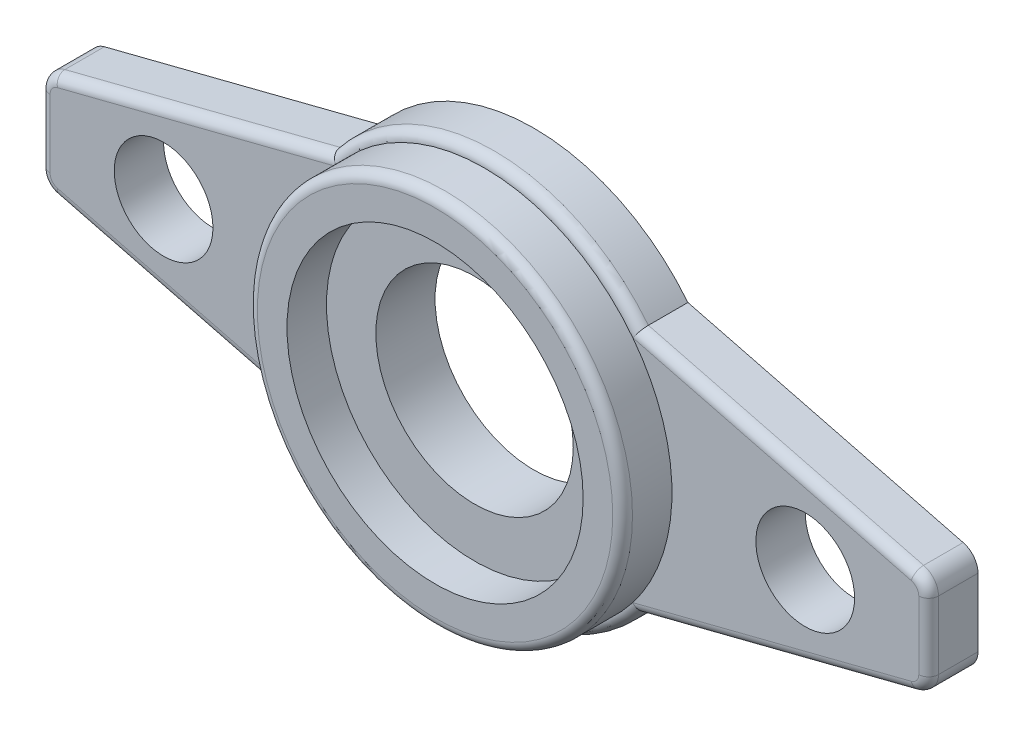
ISO-10303-21;
HEADER;
FILE_DESCRIPTION(('STEP AP214'),'2;1');
FILE_NAME('part.step','',(''),(''),'','','');
FILE_SCHEMA(('AUTOMOTIVE_DESIGN { 1 0 10303 214 1 1 1 1 }'));
ENDSEC;
DATA;
#1=APPLICATION_CONTEXT('core data for automotive mechanical design processes');
#2=APPLICATION_PROTOCOL_DEFINITION('international standard','automotive_design',2000,#1);
#3=PRODUCT_CONTEXT('',#1,'mechanical');
#4=PRODUCT('Part','Part','',(#3));
#5=PRODUCT_RELATED_PRODUCT_CATEGORY('part','',(#4));
#6=PRODUCT_DEFINITION_FORMATION('','',#4);
#7=PRODUCT_DEFINITION_CONTEXT('part definition',#1,'design');
#8=PRODUCT_DEFINITION('design','',#6,#7);
#9=PRODUCT_DEFINITION_SHAPE('','',#8);
#10=(LENGTH_UNIT() NAMED_UNIT(*) SI_UNIT(.MILLI.,.METRE.));
#11=(NAMED_UNIT(*) PLANE_ANGLE_UNIT() SI_UNIT($,.RADIAN.));
#12=(NAMED_UNIT(*) SI_UNIT($,.STERADIAN.) SOLID_ANGLE_UNIT());
#13=UNCERTAINTY_MEASURE_WITH_UNIT(LENGTH_MEASURE(1.E-05),#10,'distance_accuracy_value','');
#14=(GEOMETRIC_REPRESENTATION_CONTEXT(3) GLOBAL_UNCERTAINTY_ASSIGNED_CONTEXT((#13)) GLOBAL_UNIT_ASSIGNED_CONTEXT((#10,
#11,#12)) REPRESENTATION_CONTEXT('',''));
#15=CARTESIAN_POINT('',(0.,0.,0.));
#16=DIRECTION('',(0.,0.,1.));
#17=DIRECTION('',(1.,0.,0.));
#18=AXIS2_PLACEMENT_3D('',#15,#16,#17);
#19=CARTESIAN_POINT('',(0.,0.,5.));
#20=DIRECTION('',(0.,0.,1.));
#21=DIRECTION('',(1.,0.,0.));
#22=AXIS2_PLACEMENT_3D('',#19,#20,#21);
#23=PLANE('',#22);
#24=CARTESIAN_POINT('',(32.5,0.,5.));
#25=DIRECTION('',(0.,0.,1.));
#26=DIRECTION('',(1.,0.,0.));
#27=AXIS2_PLACEMENT_3D('',#24,#25,#26);
#28=CIRCLE('',#27,5.);
#29=CARTESIAN_POINT('',(37.5,0.,5.));
#30=VERTEX_POINT('',#29);
#31=EDGE_CURVE('E200',#30,#30,#28,.T.);
#32=ORIENTED_EDGE('',*,*,#31,.F.);
#33=EDGE_LOOP('',(#32));
#34=FACE_BOUND('',#33,.T.);
#35=CARTESIAN_POINT('',(43.,3.4463159724792,5.));
#36=DIRECTION('',(0.,0.,1.));
#37=DIRECTION('',(1.,0.,0.));
#38=AXIS2_PLACEMENT_3D('',#35,#36,#37);
#39=CIRCLE('',#38,1.);
#40=CARTESIAN_POINT('',(44.,3.4463159724792,5.));
#41=VERTEX_POINT('',#40);
#42=CARTESIAN_POINT('',(43.2472844167774,4.41525891054058,5.));
#43=VERTEX_POINT('',#42);
#44=EDGE_CURVE('E279',#41,#43,#39,.T.);
#45=ORIENTED_EDGE('',*,*,#44,.T.);
#46=DIRECTION('',(-0.968942938061382,0.247284416777479,0.));
#47=VECTOR('',#46,1.);
#48=CARTESIAN_POINT('',(15.3652105792185,11.5310570619386,5.));
#49=LINE('',#48,#47);
#50=CARTESIAN_POINT('',(15.0363618048333,11.6149827237991,5.));
#51=VERTEX_POINT('',#50);
#52=EDGE_CURVE('E281',#43,#51,#49,.T.);
#53=ORIENTED_EDGE('',*,*,#52,.T.);
#54=CARTESIAN_POINT('',(0.,0.,5.));
#55=DIRECTION('',(0.,0.,1.));
#56=DIRECTION('',(1.,0.,0.));
#57=AXIS2_PLACEMENT_3D('',#54,#55,#56);
#58=CIRCLE('',#57,19.);
#59=CARTESIAN_POINT('',(15.0363618048333,-11.6149827237991,5.));
#60=VERTEX_POINT('',#59);
#61=EDGE_CURVE('E420',#60,#51,#58,.T.);
#62=ORIENTED_EDGE('',*,*,#61,.F.);
#63=DIRECTION('',(-0.968942938061382,-0.247284416777479,0.));
#64=VECTOR('',#63,1.);
#65=CARTESIAN_POINT('',(3.70246925501234,-14.5075111678462,5.));
#66=LINE('',#65,#64);
#67=CARTESIAN_POINT('',(43.2472844167775,-4.41525891054058,5.));
#68=VERTEX_POINT('',#67);
#69=EDGE_CURVE('E273',#60,#68,#66,.F.);
#70=ORIENTED_EDGE('',*,*,#69,.T.);
#71=CARTESIAN_POINT('',(43.,-3.4463159724792,5.));
#72=DIRECTION('',(0.,0.,1.));
#73=DIRECTION('',(1.,0.,0.));
#74=AXIS2_PLACEMENT_3D('',#71,#72,#73);
#75=CIRCLE('',#74,1.);
#76=CARTESIAN_POINT('',(44.,-3.44631597247919,5.));
#77=VERTEX_POINT('',#76);
#78=EDGE_CURVE('E275',#68,#77,#75,.T.);
#79=ORIENTED_EDGE('',*,*,#78,.T.);
#80=DIRECTION('',(0.,-1.,0.));
#81=VECTOR('',#80,1.);
#82=CARTESIAN_POINT('',(44.,1.77181276592166E-13,5.));
#83=LINE('',#82,#81);
#84=EDGE_CURVE('E277',#77,#41,#83,.F.);
#85=ORIENTED_EDGE('',*,*,#84,.T.);
#86=EDGE_LOOP('',(#45,#53,#62,#70,#79,#85));
#87=FACE_BOUND('',#86,.T.);
#88=ADVANCED_FACE('F34',(#34,#87),#23,.T.);
#89=CARTESIAN_POINT('',(-45.,1.81208123787443E-13,5.));
#90=DIRECTION('',(1.,0.,0.));
#91=DIRECTION('',(0.,1.,0.));
#92=AXIS2_PLACEMENT_3D('',#89,#90,#91);
#93=PLANE('',#92);
#94=DIRECTION('',(0.,0.,-1.));
#95=VECTOR('',#94,1.);
#96=CARTESIAN_POINT('',(-45.,-3.44631597247919,5.));
#97=LINE('',#96,#95);
#98=CARTESIAN_POINT('',(-45.,-3.44631597247919,4.));
#99=VERTEX_POINT('',#98);
#100=CARTESIAN_POINT('',(-45.,-3.44631597247919,0.));
#101=VERTEX_POINT('',#100);
#102=EDGE_CURVE('E166',#99,#101,#97,.T.);
#103=ORIENTED_EDGE('',*,*,#102,.F.);
#104=DIRECTION('',(0.,-1.,0.));
#105=VECTOR('',#104,1.);
#106=CARTESIAN_POINT('',(-45.,3.44631597247919,4.));
#107=LINE('',#106,#105);
#108=CARTESIAN_POINT('',(-45.,3.44631597247919,4.));
#109=VERTEX_POINT('',#108);
#110=EDGE_CURVE('E297',#99,#109,#107,.F.);
#111=ORIENTED_EDGE('',*,*,#110,.T.);
#112=DIRECTION('',(0.,0.,-1.));
#113=VECTOR('',#112,1.);
#114=CARTESIAN_POINT('',(-45.,3.44631597247919,5.));
#115=LINE('',#114,#113);
#116=CARTESIAN_POINT('',(-45.,3.44631597247919,0.));
#117=VERTEX_POINT('',#116);
#118=EDGE_CURVE('E193',#109,#117,#115,.T.);
#119=ORIENTED_EDGE('',*,*,#118,.T.);
#120=DIRECTION('',(0.,-1.,0.));
#121=VECTOR('',#120,1.);
#122=CARTESIAN_POINT('',(-45.,1.81208123787443E-13,0.));
#123=LINE('',#122,#121);
#124=EDGE_CURVE('E185',#117,#101,#123,.T.);
#125=ORIENTED_EDGE('',*,*,#124,.T.);
#126=EDGE_LOOP('',(#103,#111,#119,#125));
#127=FACE_BOUND('',#126,.T.);
#128=ADVANCED_FACE('F191',(#127),#93,.F.);
#129=CARTESIAN_POINT('',(-43.,-3.4463159724792,5.));
#130=DIRECTION('',(0.,0.,-1.));
#131=DIRECTION('',(-1.,0.,0.));
#132=AXIS2_PLACEMENT_3D('',#129,#130,#131);
#133=CYLINDRICAL_SURFACE('',#132,2.);
#134=DIRECTION('',(0.,0.,-1.));
#135=VECTOR('',#134,1.);
#136=CARTESIAN_POINT('',(-43.4945688335549,-5.38420184860197,5.));
#137=LINE('',#136,#135);
#138=CARTESIAN_POINT('',(-43.4945688335549,-5.38420184860197,4.));
#139=VERTEX_POINT('',#138);
#140=CARTESIAN_POINT('',(-43.4945688335549,-5.38420184860197,0.));
#141=VERTEX_POINT('',#140);
#142=EDGE_CURVE('E178',#139,#141,#137,.T.);
#143=ORIENTED_EDGE('',*,*,#142,.F.);
#144=CARTESIAN_POINT('',(-43.,-3.4463159724792,4.));
#145=DIRECTION('',(0.,0.,1.));
#146=DIRECTION('',(1.,0.,0.));
#147=AXIS2_PLACEMENT_3D('',#144,#145,#146);
#148=CIRCLE('',#147,2.);
#149=EDGE_CURVE('E173',#139,#99,#148,.F.);
#150=ORIENTED_EDGE('',*,*,#149,.T.);
#151=ORIENTED_EDGE('',*,*,#102,.T.);
#152=CARTESIAN_POINT('',(-43.,-3.4463159724792,0.));
#153=DIRECTION('',(0.,0.,1.));
#154=DIRECTION('',(1.,0.,0.));
#155=AXIS2_PLACEMENT_3D('',#152,#153,#154);
#156=CIRCLE('',#155,2.);
#157=EDGE_CURVE('E170',#101,#141,#156,.T.);
#158=ORIENTED_EDGE('',*,*,#157,.T.);
#159=EDGE_LOOP('',(#143,#150,#151,#158));
#160=FACE_BOUND('',#159,.T.);
#161=ADVANCED_FACE('F169',(#160),#133,.T.);
#162=CARTESIAN_POINT('',(-3.94975367178982,-15.4764541059075,5.));
#163=DIRECTION('',(0.247284416777479,0.968942938061382,0.));
#164=DIRECTION('',(-0.968942938061382,0.247284416777479,0.));
#165=AXIS2_PLACEMENT_3D('',#162,#163,#164);
#166=PLANE('',#165);
#167=DIRECTION('',(0.,0.,-1.));
#168=VECTOR('',#167,1.);
#169=CARTESIAN_POINT('',(-15.612494995996,-12.5,5.));
#170=LINE('',#169,#168);
#171=CARTESIAN_POINT('',(-15.612494995996,-12.5,4.));
#172=VERTEX_POINT('',#171);
#173=CARTESIAN_POINT('',(-15.612494995996,-12.5,0.));
#174=VERTEX_POINT('',#173);
#175=EDGE_CURVE('E252',#172,#174,#170,.T.);
#176=ORIENTED_EDGE('',*,*,#175,.F.);
#177=DIRECTION('',(0.968942938061382,-0.247284416777479,0.));
#178=VECTOR('',#177,1.);
#179=CARTESIAN_POINT('',(-43.494568833555,-5.38420184860197,4.));
#180=LINE('',#179,#178);
#181=EDGE_CURVE('E49',#172,#139,#180,.F.);
#182=ORIENTED_EDGE('',*,*,#181,.T.);
#183=ORIENTED_EDGE('',*,*,#142,.T.);
#184=DIRECTION('',(0.968942938061382,-0.247284416777479,0.));
#185=VECTOR('',#184,1.);
#186=CARTESIAN_POINT('',(-3.94975367178982,-15.4764541059075,0.));
#187=LINE('',#186,#185);
#188=EDGE_CURVE('E189',#141,#174,#187,.T.);
#189=ORIENTED_EDGE('',*,*,#188,.T.);
#190=EDGE_LOOP('',(#176,#182,#183,#189));
#191=FACE_BOUND('',#190,.T.);
#192=ADVANCED_FACE('F478',(#191),#166,.F.);
#193=CARTESIAN_POINT('',(0.,0.,5.));
#194=DIRECTION('',(0.,0.,-1.));
#195=DIRECTION('',(-1.,0.,0.));
#196=AXIS2_PLACEMENT_3D('',#193,#194,#195);
#197=CYLINDRICAL_SURFACE('',#196,20.);
#198=DIRECTION('',(0.,0.,-1.));
#199=VECTOR('',#198,1.);
#200=CARTESIAN_POINT('',(15.612494995996,-12.5,5.));
#201=LINE('',#200,#199);
#202=CARTESIAN_POINT('',(15.612494995996,-12.5,4.));
#203=VERTEX_POINT('',#202);
#204=CARTESIAN_POINT('',(15.612494995996,-12.5,0.));
#205=VERTEX_POINT('',#204);
#206=EDGE_CURVE('E250',#203,#205,#201,.T.);
#207=ORIENTED_EDGE('',*,*,#206,.F.);
#208=CARTESIAN_POINT('',(0.,0.,4.));
#209=DIRECTION('',(0.,0.,1.));
#210=DIRECTION('',(1.,0.,0.));
#211=AXIS2_PLACEMENT_3D('',#208,#209,#210);
#212=CIRCLE('',#211,20.);
#213=EDGE_CURVE('E11',#203,#172,#212,.F.);
#214=ORIENTED_EDGE('',*,*,#213,.T.);
#215=ORIENTED_EDGE('',*,*,#175,.T.);
#216=CARTESIAN_POINT('',(0.,0.,0.));
#217=DIRECTION('',(0.,0.,1.));
#218=DIRECTION('',(1.,0.,0.));
#219=AXIS2_PLACEMENT_3D('',#216,#217,#218);
#220=CIRCLE('',#219,20.);
#221=EDGE_CURVE('E204',#174,#205,#220,.T.);
#222=ORIENTED_EDGE('',*,*,#221,.T.);
#223=EDGE_LOOP('',(#207,#214,#215,#222));
#224=FACE_BOUND('',#223,.T.);
#225=ADVANCED_FACE('F479',(#224),#197,.T.);
#226=CARTESIAN_POINT('',(3.94975367178982,-15.4764541059075,5.));
#227=DIRECTION('',(0.247284416777479,-0.968942938061382,0.));
#228=DIRECTION('',(0.968942938061382,0.247284416777479,0.));
#229=AXIS2_PLACEMENT_3D('',#226,#227,#228);
#230=PLANE('',#229);
#231=DIRECTION('',(0.,0.,-1.));
#232=VECTOR('',#231,1.);
#233=CARTESIAN_POINT('',(43.4945688335549,-5.38420184860197,5.));
#234=LINE('',#233,#232);
#235=CARTESIAN_POINT('',(43.4945688335549,-5.38420184860197,4.));
#236=VERTEX_POINT('',#235);
#237=CARTESIAN_POINT('',(43.4945688335549,-5.38420184860197,0.));
#238=VERTEX_POINT('',#237);
#239=EDGE_CURVE('E248',#236,#238,#234,.T.);
#240=ORIENTED_EDGE('',*,*,#239,.F.);
#241=DIRECTION('',(-0.968942938061382,-0.247284416777479,0.));
#242=VECTOR('',#241,1.);
#243=CARTESIAN_POINT('',(3.94975367178982,-15.4764541059075,4.));
#244=LINE('',#243,#242);
#245=EDGE_CURVE('E63',#236,#203,#244,.T.);
#246=ORIENTED_EDGE('',*,*,#245,.T.);
#247=ORIENTED_EDGE('',*,*,#206,.T.);
#248=DIRECTION('',(-0.968942938061382,-0.247284416777479,0.));
#249=VECTOR('',#248,1.);
#250=CARTESIAN_POINT('',(3.94975367178982,-15.4764541059075,0.));
#251=LINE('',#250,#249);
#252=EDGE_CURVE('E207',#238,#205,#251,.T.);
#253=ORIENTED_EDGE('',*,*,#252,.F.);
#254=EDGE_LOOP('',(#240,#246,#247,#253));
#255=FACE_BOUND('',#254,.T.);
#256=ADVANCED_FACE('F465',(#255),#230,.T.);
#257=CARTESIAN_POINT('',(43.,-3.4463159724792,5.));
#258=DIRECTION('',(0.,0.,-1.));
#259=DIRECTION('',(-1.,0.,0.));
#260=AXIS2_PLACEMENT_3D('',#257,#258,#259);
#261=CYLINDRICAL_SURFACE('',#260,2.);
#262=DIRECTION('',(0.,0.,-1.));
#263=VECTOR('',#262,1.);
#264=CARTESIAN_POINT('',(45.,-3.44631597247919,5.));
#265=LINE('',#264,#263);
#266=CARTESIAN_POINT('',(45.,-3.44631597247919,4.));
#267=VERTEX_POINT('',#266);
#268=CARTESIAN_POINT('',(45.,-3.44631597247919,0.));
#269=VERTEX_POINT('',#268);
#270=EDGE_CURVE('E246',#267,#269,#265,.T.);
#271=ORIENTED_EDGE('',*,*,#270,.F.);
#272=CARTESIAN_POINT('',(43.,-3.4463159724792,4.));
#273=DIRECTION('',(0.,0.,1.));
#274=DIRECTION('',(1.,0.,0.));
#275=AXIS2_PLACEMENT_3D('',#272,#273,#274);
#276=CIRCLE('',#275,2.);
#277=EDGE_CURVE('E291',#267,#236,#276,.F.);
#278=ORIENTED_EDGE('',*,*,#277,.T.);
#279=ORIENTED_EDGE('',*,*,#239,.T.);
#280=CARTESIAN_POINT('',(43.,-3.4463159724792,0.));
#281=DIRECTION('',(0.,0.,1.));
#282=DIRECTION('',(1.,0.,0.));
#283=AXIS2_PLACEMENT_3D('',#280,#281,#282);
#284=CIRCLE('',#283,2.);
#285=EDGE_CURVE('E211',#269,#238,#284,.F.);
#286=ORIENTED_EDGE('',*,*,#285,.F.);
#287=EDGE_LOOP('',(#271,#278,#279,#286));
#288=FACE_BOUND('',#287,.T.);
#289=ADVANCED_FACE('F462',(#288),#261,.T.);
#290=CARTESIAN_POINT('',(45.,1.81208123787443E-13,5.));
#291=DIRECTION('',(1.,0.,0.));
#292=DIRECTION('',(0.,1.,0.));
#293=AXIS2_PLACEMENT_3D('',#290,#291,#292);
#294=PLANE('',#293);
#295=DIRECTION('',(0.,0.,-1.));
#296=VECTOR('',#295,1.);
#297=CARTESIAN_POINT('',(45.,3.44631597247919,5.));
#298=LINE('',#297,#296);
#299=CARTESIAN_POINT('',(45.,3.44631597247919,4.));
#300=VERTEX_POINT('',#299);
#301=CARTESIAN_POINT('',(45.,3.44631597247919,0.));
#302=VERTEX_POINT('',#301);
#303=EDGE_CURVE('E244',#300,#302,#298,.T.);
#304=ORIENTED_EDGE('',*,*,#303,.F.);
#305=DIRECTION('',(0.,-1.,0.));
#306=VECTOR('',#305,1.);
#307=CARTESIAN_POINT('',(45.,1.81208123787443E-13,4.));
#308=LINE('',#307,#306);
#309=EDGE_CURVE('E289',#300,#267,#308,.T.);
#310=ORIENTED_EDGE('',*,*,#309,.T.);
#311=ORIENTED_EDGE('',*,*,#270,.T.);
#312=DIRECTION('',(0.,-1.,0.));
#313=VECTOR('',#312,1.);
#314=CARTESIAN_POINT('',(45.,1.81208123787443E-13,0.));
#315=LINE('',#314,#313);
#316=EDGE_CURVE('E214',#302,#269,#315,.T.);
#317=ORIENTED_EDGE('',*,*,#316,.F.);
#318=EDGE_LOOP('',(#304,#310,#311,#317));
#319=FACE_BOUND('',#318,.T.);
#320=ADVANCED_FACE('F451',(#319),#294,.T.);
#321=CARTESIAN_POINT('',(43.,3.4463159724792,5.));
#322=DIRECTION('',(0.,0.,-1.));
#323=DIRECTION('',(-1.,0.,0.));
#324=AXIS2_PLACEMENT_3D('',#321,#322,#323);
#325=CYLINDRICAL_SURFACE('',#324,2.);
#326=DIRECTION('',(0.,0.,-1.));
#327=VECTOR('',#326,1.);
#328=CARTESIAN_POINT('',(43.4945688335549,5.38420184860197,5.));
#329=LINE('',#328,#327);
#330=CARTESIAN_POINT('',(43.4945688335549,5.38420184860197,4.));
#331=VERTEX_POINT('',#330);
#332=CARTESIAN_POINT('',(43.4945688335549,5.38420184860197,0.));
#333=VERTEX_POINT('',#332);
#334=EDGE_CURVE('E242',#331,#333,#329,.T.);
#335=ORIENTED_EDGE('',*,*,#334,.F.);
#336=CARTESIAN_POINT('',(43.,3.4463159724792,4.));
#337=DIRECTION('',(0.,0.,1.));
#338=DIRECTION('',(1.,0.,0.));
#339=AXIS2_PLACEMENT_3D('',#336,#337,#338);
#340=CIRCLE('',#339,2.);
#341=EDGE_CURVE('E287',#331,#300,#340,.F.);
#342=ORIENTED_EDGE('',*,*,#341,.T.);
#343=ORIENTED_EDGE('',*,*,#303,.T.);
#344=CARTESIAN_POINT('',(43.,3.4463159724792,0.));
#345=DIRECTION('',(0.,0.,1.));
#346=DIRECTION('',(1.,0.,0.));
#347=AXIS2_PLACEMENT_3D('',#344,#345,#346);
#348=CIRCLE('',#347,2.);
#349=EDGE_CURVE('E217',#302,#333,#348,.T.);
#350=ORIENTED_EDGE('',*,*,#349,.T.);
#351=EDGE_LOOP('',(#335,#342,#343,#350));
#352=FACE_BOUND('',#351,.T.);
#353=ADVANCED_FACE('F446',(#352),#325,.T.);
#354=CARTESIAN_POINT('',(3.94975367178983,15.4764541059075,5.));
#355=DIRECTION('',(-0.247284416777479,-0.968942938061382,0.));
#356=DIRECTION('',(0.968942938061382,-0.247284416777479,0.));
#357=AXIS2_PLACEMENT_3D('',#354,#355,#356);
#358=PLANE('',#357);
#359=DIRECTION('',(0.,0.,-1.));
#360=VECTOR('',#359,1.);
#361=CARTESIAN_POINT('',(15.612494995996,12.5,5.));
#362=LINE('',#361,#360);
#363=CARTESIAN_POINT('',(15.612494995996,12.5,4.));
#364=VERTEX_POINT('',#363);
#365=CARTESIAN_POINT('',(15.612494995996,12.5,0.));
#366=VERTEX_POINT('',#365);
#367=EDGE_CURVE('E240',#364,#366,#362,.T.);
#368=ORIENTED_EDGE('',*,*,#367,.F.);
#369=DIRECTION('',(-0.968942938061382,0.247284416777479,0.));
#370=VECTOR('',#369,1.);
#371=CARTESIAN_POINT('',(43.4945688335549,5.38420184860196,4.));
#372=LINE('',#371,#370);
#373=EDGE_CURVE('E284',#364,#331,#372,.F.);
#374=ORIENTED_EDGE('',*,*,#373,.T.);
#375=ORIENTED_EDGE('',*,*,#334,.T.);
#376=DIRECTION('',(-0.968942938061382,0.247284416777479,0.));
#377=VECTOR('',#376,1.);
#378=CARTESIAN_POINT('',(3.94975367178983,15.4764541059075,0.));
#379=LINE('',#378,#377);
#380=EDGE_CURVE('E220',#333,#366,#379,.T.);
#381=ORIENTED_EDGE('',*,*,#380,.T.);
#382=EDGE_LOOP('',(#368,#374,#375,#381));
#383=FACE_BOUND('',#382,.T.);
#384=ADVANCED_FACE('F434',(#383),#358,.F.);
#385=DIRECTION('',(0.,0.,-1.));
#386=VECTOR('',#385,1.);
#387=CARTESIAN_POINT('',(-15.612494995996,12.5,5.));
#388=LINE('',#387,#386);
#389=CARTESIAN_POINT('',(-15.612494995996,12.5,4.));
#390=VERTEX_POINT('',#389);
#391=CARTESIAN_POINT('',(-15.612494995996,12.5,0.));
#392=VERTEX_POINT('',#391);
#393=EDGE_CURVE('E238',#390,#392,#388,.T.);
#394=ORIENTED_EDGE('',*,*,#393,.F.);
#395=CARTESIAN_POINT('',(0.,0.,4.));
#396=DIRECTION('',(0.,0.,1.));
#397=DIRECTION('',(1.,0.,0.));
#398=AXIS2_PLACEMENT_3D('',#395,#396,#397);
#399=CIRCLE('',#398,20.);
#400=EDGE_CURVE('E300',#390,#364,#399,.F.);
#401=ORIENTED_EDGE('',*,*,#400,.T.);
#402=ORIENTED_EDGE('',*,*,#367,.T.);
#403=EDGE_CURVE('E208',#366,#392,#220,.T.);
#404=ORIENTED_EDGE('',*,*,#403,.T.);
#405=EDGE_LOOP('',(#394,#401,#402,#404));
#406=FACE_BOUND('',#405,.T.);
#407=ADVANCED_FACE('F430',(#406),#197,.T.);
#408=CARTESIAN_POINT('',(-3.94975367178983,15.4764541059075,5.));
#409=DIRECTION('',(-0.247284416777479,0.968942938061382,0.));
#410=DIRECTION('',(-0.968942938061382,-0.247284416777479,0.));
#411=AXIS2_PLACEMENT_3D('',#408,#409,#410);
#412=PLANE('',#411);
#413=DIRECTION('',(0.,0.,-1.));
#414=VECTOR('',#413,1.);
#415=CARTESIAN_POINT('',(-43.4945688335549,5.38420184860197,5.));
#416=LINE('',#415,#414);
#417=CARTESIAN_POINT('',(-43.4945688335549,5.38420184860197,4.));
#418=VERTEX_POINT('',#417);
#419=CARTESIAN_POINT('',(-43.4945688335549,5.38420184860197,0.));
#420=VERTEX_POINT('',#419);
#421=EDGE_CURVE('E236',#418,#420,#416,.T.);
#422=ORIENTED_EDGE('',*,*,#421,.F.);
#423=DIRECTION('',(0.968942938061382,0.247284416777479,0.));
#424=VECTOR('',#423,1.);
#425=CARTESIAN_POINT('',(-3.94975367178983,15.4764541059075,4.));
#426=LINE('',#425,#424);
#427=EDGE_CURVE('E293',#418,#390,#426,.T.);
#428=ORIENTED_EDGE('',*,*,#427,.T.);
#429=ORIENTED_EDGE('',*,*,#393,.T.);
#430=DIRECTION('',(0.968942938061382,0.247284416777479,0.));
#431=VECTOR('',#430,1.);
#432=CARTESIAN_POINT('',(-3.94975367178983,15.4764541059075,0.));
#433=LINE('',#432,#431);
#434=EDGE_CURVE('E223',#420,#392,#433,.T.);
#435=ORIENTED_EDGE('',*,*,#434,.F.);
#436=EDGE_LOOP('',(#422,#428,#429,#435));
#437=FACE_BOUND('',#436,.T.);
#438=ADVANCED_FACE('F483',(#437),#412,.T.);
#439=CARTESIAN_POINT('',(-32.5,0.,5.));
#440=DIRECTION('',(0.,0.,-1.));
#441=DIRECTION('',(-1.,0.,0.));
#442=AXIS2_PLACEMENT_3D('',#439,#440,#441);
#443=CYLINDRICAL_SURFACE('',#442,5.);
#444=CARTESIAN_POINT('',(-32.5,0.,5.));
#445=DIRECTION('',(0.,0.,1.));
#446=DIRECTION('',(1.,0.,0.));
#447=AXIS2_PLACEMENT_3D('',#444,#445,#446);
#448=CIRCLE('',#447,5.);
#449=CARTESIAN_POINT('',(-27.5,0.,5.));
#450=VERTEX_POINT('',#449);
#451=EDGE_CURVE('E234',#450,#450,#448,.F.);
#452=ORIENTED_EDGE('',*,*,#451,.F.);
#453=EDGE_LOOP('',(#452));
#454=FACE_BOUND('',#453,.T.);
#455=CARTESIAN_POINT('',(-32.5,0.,0.));
#456=DIRECTION('',(0.,0.,1.));
#457=DIRECTION('',(1.,0.,0.));
#458=AXIS2_PLACEMENT_3D('',#455,#456,#457);
#459=CIRCLE('',#458,5.);
#460=CARTESIAN_POINT('',(-27.5,0.,0.));
#461=VERTEX_POINT('',#460);
#462=EDGE_CURVE('E228',#461,#461,#459,.F.);
#463=ORIENTED_EDGE('',*,*,#462,.T.);
#464=EDGE_LOOP('',(#463));
#465=FACE_BOUND('',#464,.T.);
#466=ADVANCED_FACE('F493',(#454,#465),#443,.F.);
#467=CARTESIAN_POINT('',(-43.,3.4463159724792,5.));
#468=DIRECTION('',(0.,0.,-1.));
#469=DIRECTION('',(-1.,0.,0.));
#470=AXIS2_PLACEMENT_3D('',#467,#468,#469);
#471=CYLINDRICAL_SURFACE('',#470,2.);
#472=ORIENTED_EDGE('',*,*,#118,.F.);
#473=CARTESIAN_POINT('',(-43.,3.4463159724792,4.));
#474=DIRECTION('',(0.,0.,1.));
#475=DIRECTION('',(1.,0.,0.));
#476=AXIS2_PLACEMENT_3D('',#473,#474,#475);
#477=CIRCLE('',#476,2.);
#478=EDGE_CURVE('E295',#109,#418,#477,.F.);
#479=ORIENTED_EDGE('',*,*,#478,.T.);
#480=ORIENTED_EDGE('',*,*,#421,.T.);
#481=CARTESIAN_POINT('',(-43.,3.4463159724792,0.));
#482=DIRECTION('',(0.,0.,1.));
#483=DIRECTION('',(1.,0.,0.));
#484=AXIS2_PLACEMENT_3D('',#481,#482,#483);
#485=CIRCLE('',#484,2.);
#486=EDGE_CURVE('E226',#117,#420,#485,.F.);
#487=ORIENTED_EDGE('',*,*,#486,.F.);
#488=EDGE_LOOP('',(#472,#479,#480,#487));
#489=FACE_BOUND('',#488,.T.);
#490=ADVANCED_FACE('F400',(#489),#471,.T.);
#491=CARTESIAN_POINT('',(32.5,0.,5.));
#492=DIRECTION('',(0.,0.,-1.));
#493=DIRECTION('',(-1.,0.,0.));
#494=AXIS2_PLACEMENT_3D('',#491,#492,#493);
#495=CYLINDRICAL_SURFACE('',#494,5.);
#496=ORIENTED_EDGE('',*,*,#31,.T.);
#497=EDGE_LOOP('',(#496));
#498=FACE_BOUND('',#497,.T.);
#499=CARTESIAN_POINT('',(32.5,0.,0.));
#500=DIRECTION('',(0.,0.,1.));
#501=DIRECTION('',(1.,0.,0.));
#502=AXIS2_PLACEMENT_3D('',#499,#500,#501);
#503=CIRCLE('',#502,5.);
#504=CARTESIAN_POINT('',(37.5,0.,0.));
#505=VERTEX_POINT('',#504);
#506=EDGE_CURVE('E231',#505,#505,#503,.T.);
#507=ORIENTED_EDGE('',*,*,#506,.F.);
#508=EDGE_LOOP('',(#507));
#509=FACE_BOUND('',#508,.T.);
#510=ADVANCED_FACE('F393',(#498,#509),#495,.F.);
#511=ORIENTED_EDGE('',*,*,#451,.T.);
#512=EDGE_LOOP('',(#511));
#513=FACE_BOUND('',#512,.T.);
#514=CARTESIAN_POINT('',(-15.0363618048333,11.6149827237991,5.));
#515=VERTEX_POINT('',#514);
#516=CARTESIAN_POINT('',(-15.0363618048333,-11.6149827237991,5.));
#517=VERTEX_POINT('',#516);
#518=EDGE_CURVE('E407',#515,#517,#58,.T.);
#519=ORIENTED_EDGE('',*,*,#518,.F.);
#520=DIRECTION('',(0.968942938061382,0.247284416777479,0.));
#521=VECTOR('',#520,1.);
#522=CARTESIAN_POINT('',(-3.70246925501235,14.5075111678462,5.));
#523=LINE('',#522,#521);
#524=CARTESIAN_POINT('',(-43.2472844167774,4.41525891054058,5.));
#525=VERTEX_POINT('',#524);
#526=EDGE_CURVE('E271',#515,#525,#523,.F.);
#527=ORIENTED_EDGE('',*,*,#526,.T.);
#528=CARTESIAN_POINT('',(-43.,3.4463159724792,5.));
#529=DIRECTION('',(0.,0.,1.));
#530=DIRECTION('',(1.,0.,0.));
#531=AXIS2_PLACEMENT_3D('',#528,#529,#530);
#532=CIRCLE('',#531,1.);
#533=CARTESIAN_POINT('',(-44.,3.4463159724792,5.));
#534=VERTEX_POINT('',#533);
#535=EDGE_CURVE('E269',#525,#534,#532,.T.);
#536=ORIENTED_EDGE('',*,*,#535,.T.);
#537=DIRECTION('',(0.,-1.,0.));
#538=VECTOR('',#537,1.);
#539=CARTESIAN_POINT('',(-44.,-3.44631597247919,5.));
#540=LINE('',#539,#538);
#541=CARTESIAN_POINT('',(-44.,-3.44631597247919,5.));
#542=VERTEX_POINT('',#541);
#543=EDGE_CURVE('E267',#534,#542,#540,.T.);
#544=ORIENTED_EDGE('',*,*,#543,.T.);
#545=CARTESIAN_POINT('',(-43.,-3.4463159724792,5.));
#546=DIRECTION('',(0.,0.,1.));
#547=DIRECTION('',(1.,0.,0.));
#548=AXIS2_PLACEMENT_3D('',#545,#546,#547);
#549=CIRCLE('',#548,1.);
#550=CARTESIAN_POINT('',(-43.2472844167775,-4.41525891054058,5.));
#551=VERTEX_POINT('',#550);
#552=EDGE_CURVE('E265',#542,#551,#549,.T.);
#553=ORIENTED_EDGE('',*,*,#552,.T.);
#554=DIRECTION('',(0.968942938061382,-0.247284416777479,0.));
#555=VECTOR('',#554,1.);
#556=CARTESIAN_POINT('',(-15.3652105792185,-11.5310570619386,5.));
#557=LINE('',#556,#555);
#558=EDGE_CURVE('E263',#551,#517,#557,.T.);
#559=ORIENTED_EDGE('',*,*,#558,.T.);
#560=EDGE_LOOP('',(#519,#527,#536,#544,#553,#559));
#561=FACE_BOUND('',#560,.T.);
#562=ADVANCED_FACE('F383',(#513,#561),#23,.T.);
#563=CARTESIAN_POINT('',(0.,0.,0.));
#564=DIRECTION('',(0.,0.,1.));
#565=DIRECTION('',(1.,0.,0.));
#566=AXIS2_PLACEMENT_3D('',#563,#564,#565);
#567=PLANE('',#566);
#568=ORIENTED_EDGE('',*,*,#124,.F.);
#569=ORIENTED_EDGE('',*,*,#486,.T.);
#570=ORIENTED_EDGE('',*,*,#434,.T.);
#571=ORIENTED_EDGE('',*,*,#403,.F.);
#572=ORIENTED_EDGE('',*,*,#380,.F.);
#573=ORIENTED_EDGE('',*,*,#349,.F.);
#574=ORIENTED_EDGE('',*,*,#316,.T.);
#575=ORIENTED_EDGE('',*,*,#285,.T.);
#576=ORIENTED_EDGE('',*,*,#252,.T.);
#577=ORIENTED_EDGE('',*,*,#221,.F.);
#578=ORIENTED_EDGE('',*,*,#188,.F.);
#579=ORIENTED_EDGE('',*,*,#157,.F.);
#580=EDGE_LOOP('',(#568,#569,#570,#571,#572,#573,#574,#575,#576,#577,#578,#579));
#581=FACE_BOUND('',#580,.T.);
#582=ORIENTED_EDGE('',*,*,#462,.F.);
#583=EDGE_LOOP('',(#582));
#584=FACE_BOUND('',#583,.T.);
#585=ORIENTED_EDGE('',*,*,#506,.T.);
#586=EDGE_LOOP('',(#585));
#587=FACE_BOUND('',#586,.T.);
#588=CARTESIAN_POINT('',(0.,0.,0.));
#589=DIRECTION('',(0.,0.,1.));
#590=DIRECTION('',(1.,0.,0.));
#591=AXIS2_PLACEMENT_3D('',#588,#589,#590);
#592=CIRCLE('',#591,10.);
#593=CARTESIAN_POINT('',(10.,0.,0.));
#594=VERTEX_POINT('',#593);
#595=EDGE_CURVE('E472',#594,#594,#592,.T.);
#596=ORIENTED_EDGE('',*,*,#595,.T.);
#597=EDGE_LOOP('',(#596));
#598=FACE_BOUND('',#597,.T.);
#599=ADVANCED_FACE('F182',(#581,#584,#587,#598),#567,.F.);
#600=CARTESIAN_POINT('',(0.,0.,10.));
#601=DIRECTION('',(0.,0.,-1.));
#602=DIRECTION('',(-1.,0.,0.));
#603=AXIS2_PLACEMENT_3D('',#600,#601,#602);
#604=CYLINDRICAL_SURFACE('',#603,15.);
#605=CARTESIAN_POINT('',(0.,0.,6.));
#606=DIRECTION('',(0.,0.,1.));
#607=DIRECTION('',(1.,0.,0.));
#608=AXIS2_PLACEMENT_3D('',#605,#606,#607);
#609=CIRCLE('',#608,15.);
#610=CARTESIAN_POINT('',(15.,0.,6.));
#611=VERTEX_POINT('',#610);
#612=EDGE_CURVE('E177',#611,#611,#609,.T.);
#613=ORIENTED_EDGE('',*,*,#612,.F.);
#614=EDGE_LOOP('',(#613));
#615=FACE_BOUND('',#614,.T.);
#616=CARTESIAN_POINT('',(0.,0.,10.));
#617=DIRECTION('',(0.,0.,1.));
#618=DIRECTION('',(1.,0.,0.));
#619=AXIS2_PLACEMENT_3D('',#616,#617,#618);
#620=CIRCLE('',#619,15.);
#621=CARTESIAN_POINT('',(15.,0.,10.));
#622=VERTEX_POINT('',#621);
#623=EDGE_CURVE('E194',#622,#622,#620,.T.);
#624=ORIENTED_EDGE('',*,*,#623,.T.);
#625=EDGE_LOOP('',(#624));
#626=FACE_BOUND('',#625,.T.);
#627=ADVANCED_FACE('F399',(#615,#626),#604,.F.);
#628=CARTESIAN_POINT('',(0.,0.,10.));
#629=DIRECTION('',(0.,0.,-1.));
#630=DIRECTION('',(-1.,0.,0.));
#631=AXIS2_PLACEMENT_3D('',#628,#629,#630);
#632=CYLINDRICAL_SURFACE('',#631,19.);
#633=CARTESIAN_POINT('',(0.,0.,9.));
#634=DIRECTION('',(0.,0.,1.));
#635=DIRECTION('',(1.,0.,0.));
#636=AXIS2_PLACEMENT_3D('',#633,#634,#635);
#637=CIRCLE('',#636,19.);
#638=CARTESIAN_POINT('',(19.,0.,9.));
#639=VERTEX_POINT('',#638);
#640=EDGE_CURVE('E260',#639,#639,#637,.F.);
#641=ORIENTED_EDGE('',*,*,#640,.T.);
#642=EDGE_LOOP('',(#641));
#643=FACE_BOUND('',#642,.T.);
#644=EDGE_CURVE('E415',#51,#515,#58,.T.);
#645=ORIENTED_EDGE('',*,*,#644,.T.);
#646=ORIENTED_EDGE('',*,*,#518,.T.);
#647=EDGE_CURVE('E416',#517,#60,#58,.T.);
#648=ORIENTED_EDGE('',*,*,#647,.T.);
#649=ORIENTED_EDGE('',*,*,#61,.T.);
#650=EDGE_LOOP('',(#645,#646,#648,#649));
#651=FACE_BOUND('',#650,.T.);
#652=ADVANCED_FACE('F419',(#643,#651),#632,.T.);
#653=CARTESIAN_POINT('',(0.,0.,10.));
#654=DIRECTION('',(0.,0.,1.));
#655=DIRECTION('',(1.,0.,0.));
#656=AXIS2_PLACEMENT_3D('',#653,#654,#655);
#657=PLANE('',#656);
#658=CARTESIAN_POINT('',(0.,0.,10.));
#659=DIRECTION('',(0.,0.,1.));
#660=DIRECTION('',(1.,0.,0.));
#661=AXIS2_PLACEMENT_3D('',#658,#659,#660);
#662=CIRCLE('',#661,18.);
#663=CARTESIAN_POINT('',(18.,0.,10.));
#664=VERTEX_POINT('',#663);
#665=EDGE_CURVE('E257',#664,#664,#662,.T.);
#666=ORIENTED_EDGE('',*,*,#665,.T.);
#667=EDGE_LOOP('',(#666));
#668=FACE_BOUND('',#667,.T.);
#669=ORIENTED_EDGE('',*,*,#623,.F.);
#670=EDGE_LOOP('',(#669));
#671=FACE_BOUND('',#670,.T.);
#672=ADVANCED_FACE('F533',(#668,#671),#657,.T.);
#673=CARTESIAN_POINT('',(0.,0.,6.));
#674=DIRECTION('',(0.,0.,-1.));
#675=DIRECTION('',(-1.,0.,0.));
#676=AXIS2_PLACEMENT_3D('',#673,#674,#675);
#677=CYLINDRICAL_SURFACE('',#676,10.);
#678=CARTESIAN_POINT('',(0.,0.,6.));
#679=DIRECTION('',(0.,0.,1.));
#680=DIRECTION('',(1.,0.,0.));
#681=AXIS2_PLACEMENT_3D('',#678,#679,#680);
#682=CIRCLE('',#681,10.);
#683=CARTESIAN_POINT('',(10.,0.,6.));
#684=VERTEX_POINT('',#683);
#685=EDGE_CURVE('E197',#684,#684,#682,.T.);
#686=ORIENTED_EDGE('',*,*,#685,.T.);
#687=EDGE_LOOP('',(#686));
#688=FACE_BOUND('',#687,.T.);
#689=ORIENTED_EDGE('',*,*,#595,.F.);
#690=EDGE_LOOP('',(#689));
#691=FACE_BOUND('',#690,.T.);
#692=ADVANCED_FACE('F526',(#688,#691),#677,.F.);
#693=CARTESIAN_POINT('',(0.,0.,6.));
#694=DIRECTION('',(0.,0.,1.));
#695=DIRECTION('',(1.,0.,0.));
#696=AXIS2_PLACEMENT_3D('',#693,#694,#695);
#697=PLANE('',#696);
#698=ORIENTED_EDGE('',*,*,#685,.F.);
#699=EDGE_LOOP('',(#698));
#700=FACE_BOUND('',#699,.T.);
#701=ORIENTED_EDGE('',*,*,#612,.T.);
#702=EDGE_LOOP('',(#701));
#703=FACE_BOUND('',#702,.T.);
#704=ADVANCED_FACE('F520',(#700,#703),#697,.T.);
#705=CARTESIAN_POINT('',(0.,0.,9.));
#706=DIRECTION('',(0.,0.,1.));
#707=DIRECTION('',(1.,0.,0.));
#708=AXIS2_PLACEMENT_3D('',#705,#706,#707);
#709=TOROIDAL_SURFACE('',#708,18.,1.);
#710=ORIENTED_EDGE('',*,*,#640,.F.);
#711=EDGE_LOOP('',(#710));
#712=FACE_BOUND('',#711,.T.);
#713=ORIENTED_EDGE('',*,*,#665,.F.);
#714=EDGE_LOOP('',(#713));
#715=FACE_BOUND('',#714,.T.);
#716=ADVANCED_FACE('F518',(#712,#715),#709,.T.);
#717=CARTESIAN_POINT('',(-3.70246925501234,-14.5075111678462,4.));
#718=DIRECTION('',(-0.968942938061382,0.247284416777479,0.));
#719=DIRECTION('',(-0.247284416777479,-0.968942938061382,0.));
#720=AXIS2_PLACEMENT_3D('',#717,#718,#719);
#721=CYLINDRICAL_SURFACE('',#720,1.);
#722=CARTESIAN_POINT('',(-43.2472844167775,-4.41525891054059,4.));
#723=DIRECTION('',(-0.968942938061381,0.247284416777481,0.));
#724=DIRECTION('',(-0.247284416777481,-0.968942938061381,0.));
#725=AXIS2_PLACEMENT_3D('',#722,#723,#724);
#726=CIRCLE('',#725,1.);
#727=EDGE_CURVE('E362',#139,#551,#726,.T.);
#728=ORIENTED_EDGE('',*,*,#727,.F.);
#729=ORIENTED_EDGE('',*,*,#181,.F.);
#730=CARTESIAN_POINT('',(-15.612494995996,-12.5,4.));
#731=CARTESIAN_POINT('',(-15.612495253481,-12.5000004957519,4.02707544761508));
#732=CARTESIAN_POINT('',(-15.611866143339,-12.4990248500623,4.05413754205934));
#733=CARTESIAN_POINT('',(-15.6093588087077,-12.4951370102495,4.10805999087438));
#734=CARTESIAN_POINT('',(-15.6074807718161,-12.492225106966,4.1349203749308));
#735=CARTESIAN_POINT('',(-15.6000022768076,-12.480631206414,4.21478996969502));
#736=CARTESIAN_POINT('',(-15.5925573006006,-12.4690908019241,4.26725075155689));
#737=CARTESIAN_POINT('',(-15.5730095654755,-12.4388078458416,4.36909735332611));
#738=CARTESIAN_POINT('',(-15.5609069010154,-12.4200654403058,4.41848323556897));
#739=CARTESIAN_POINT('',(-15.5324504958037,-12.3760326457606,4.51292688767509));
#740=CARTESIAN_POINT('',(-15.516095999461,-12.3507410929085,4.55798388630341));
#741=CARTESIAN_POINT('',(-15.4792602102681,-12.2938323384837,4.64357896416844));
#742=CARTESIAN_POINT('',(-15.4586981107906,-12.2620913767311,4.68399973642197));
#743=CARTESIAN_POINT('',(-15.414290439685,-12.1936216412033,4.75828624235036));
#744=CARTESIAN_POINT('',(-15.3904437841404,-12.1568912209424,4.79214980320752));
#745=CARTESIAN_POINT('',(-15.3388895669913,-12.0775880443687,4.85412609585735));
#746=CARTESIAN_POINT('',(-15.3110499085396,-12.0348169557071,4.88187472703123));
#747=CARTESIAN_POINT('',(-15.253249891511,-11.9461501161067,4.92887008367342));
#748=CARTESIAN_POINT('',(-15.2232894709747,-11.9002542738775,4.94811656062672));
#749=CARTESIAN_POINT('',(-15.1679366601992,-11.8155940986518,4.97492814419142));
#750=CARTESIAN_POINT('',(-15.1427729553463,-11.7771543658159,4.98402736609862));
#751=CARTESIAN_POINT('',(-15.0920044869675,-11.6997021350582,4.99637495546551));
#752=CARTESIAN_POINT('',(-15.0664006598989,-11.6606908743445,4.99963448906175));
#753=CARTESIAN_POINT('',(-15.0393132197994,-11.619473237978,4.99999034196309));
#754=CARTESIAN_POINT('',(-15.0378375028969,-11.6172278814087,5.00000002439089));
#755=CARTESIAN_POINT('',(-15.0363618048333,-11.6149827237991,5.));
#756=B_SPLINE_CURVE_WITH_KNOTS('',3,(#730,#731,#732,#733,#734,#735,#736,#737,#738,#739,#740,
#741,#742,#743,#744,#745,#746,#747,#748,#749,#750,#751,#752,#753,#754,#755),.UNSPECIFIED.,.F.,
.F.,(4,2,2,2,2,2,2,2,2,2,2,2,4),(0.,0.0811751462274574,0.162338102125421,0.324181015613261,
0.486020647092294,0.647889058698,0.813220645993741,0.978606924671194,1.15211542434316,
1.32562899527295,1.46579581231098,1.6056943275229,1.61375496094806),.UNSPECIFIED.);
#757=EDGE_CURVE('E39',#517,#172,#756,.F.);
#758=ORIENTED_EDGE('',*,*,#757,.F.);
#759=ORIENTED_EDGE('',*,*,#558,.F.);
#760=EDGE_LOOP('',(#728,#729,#758,#759));
#761=FACE_BOUND('',#760,.T.);
#762=ADVANCED_FACE('F36',(#761),#721,.T.);
#763=CARTESIAN_POINT('',(0.,0.,4.));
#764=DIRECTION('',(0.,0.,1.));
#765=DIRECTION('',(1.,0.,0.));
#766=AXIS2_PLACEMENT_3D('',#763,#764,#765);
#767=TOROIDAL_SURFACE('',#766,19.,1.);
#768=ORIENTED_EDGE('',*,*,#757,.T.);
#769=ORIENTED_EDGE('',*,*,#213,.F.);
#770=CARTESIAN_POINT('',(15.612494995996,-12.5,4.));
#771=CARTESIAN_POINT('',(15.612495253481,-12.5000004957519,4.02707544761508));
#772=CARTESIAN_POINT('',(15.611866143339,-12.4990248500623,4.05413754205934));
#773=CARTESIAN_POINT('',(15.6093588087077,-12.4951370102495,4.10805999087438));
#774=CARTESIAN_POINT('',(15.6074807718161,-12.492225106966,4.1349203749308));
#775=CARTESIAN_POINT('',(15.6000022768076,-12.480631206414,4.21478996969502));
#776=CARTESIAN_POINT('',(15.5925573006006,-12.4690908019241,4.26725075155689));
#777=CARTESIAN_POINT('',(15.5730095654755,-12.4388078458416,4.36909735332611));
#778=CARTESIAN_POINT('',(15.5609069010154,-12.4200654403058,4.41848323556897));
#779=CARTESIAN_POINT('',(15.5324504958037,-12.3760326457606,4.51292688767509));
#780=CARTESIAN_POINT('',(15.516095999461,-12.3507410929085,4.55798388630341));
#781=CARTESIAN_POINT('',(15.4792602102681,-12.2938323384836,4.64357896416844));
#782=CARTESIAN_POINT('',(15.4586981107906,-12.2620913767311,4.68399973642197));
#783=CARTESIAN_POINT('',(15.414290439685,-12.1936216412033,4.75828624235037));
#784=CARTESIAN_POINT('',(15.3904437841404,-12.1568912209424,4.79214980320752));
#785=CARTESIAN_POINT('',(15.3388895669913,-12.0775880443687,4.85412609585736));
#786=CARTESIAN_POINT('',(15.3110499085396,-12.0348169557071,4.88187472703123));
#787=CARTESIAN_POINT('',(15.253249891511,-11.9461501161067,4.92887008367343));
#788=CARTESIAN_POINT('',(15.2232894709747,-11.9002542738775,4.94811656062672));
#789=CARTESIAN_POINT('',(15.1679366601992,-11.8155940986518,4.97492814419142));
#790=CARTESIAN_POINT('',(15.1427729553463,-11.7771543658159,4.98402736609862));
#791=CARTESIAN_POINT('',(15.0920044869674,-11.6997021350582,4.99637495546551));
#792=CARTESIAN_POINT('',(15.0664006598988,-11.6606908743446,4.99963448906175));
#793=CARTESIAN_POINT('',(15.0393132197994,-11.6194732379781,4.99999034196309));
#794=CARTESIAN_POINT('',(15.0378375028969,-11.6172278814087,5.00000002439089));
#795=CARTESIAN_POINT('',(15.0363618048333,-11.6149827237991,5.));
#796=B_SPLINE_CURVE_WITH_KNOTS('',3,(#770,#771,#772,#773,#774,#775,#776,#777,#778,#779,#780,
#781,#782,#783,#784,#785,#786,#787,#788,#789,#790,#791,#792,#793,#794,#795),.UNSPECIFIED.,.F.,
.F.,(4,2,2,2,2,2,2,2,2,2,2,2,4),(0.,0.0811751462274574,0.16233810212542,0.324181015613261,
0.486020647092294,0.647889058698,0.813220645993744,0.978606924671195,1.15211542434316,
1.32562899527295,1.46579581231097,1.6056943275229,1.61375496094806),.UNSPECIFIED.);
#797=EDGE_CURVE('E355',#60,#203,#796,.F.);
#798=ORIENTED_EDGE('',*,*,#797,.F.);
#799=ORIENTED_EDGE('',*,*,#647,.F.);
#800=EDGE_LOOP('',(#768,#769,#798,#799));
#801=FACE_BOUND('',#800,.T.);
#802=ADVANCED_FACE('F366',(#801),#767,.T.);
#803=CARTESIAN_POINT('',(-43.,-3.4463159724792,4.));
#804=DIRECTION('',(0.,0.,1.));
#805=DIRECTION('',(1.,0.,0.));
#806=AXIS2_PLACEMENT_3D('',#803,#804,#805);
#807=TOROIDAL_SURFACE('',#806,1.,1.);
#808=ORIENTED_EDGE('',*,*,#727,.T.);
#809=ORIENTED_EDGE('',*,*,#552,.F.);
#810=CARTESIAN_POINT('',(-44.,-3.4463159724792,4.));
#811=DIRECTION('',(0.,1.,0.));
#812=DIRECTION('',(-1.,0.,0.));
#813=AXIS2_PLACEMENT_3D('',#810,#811,#812);
#814=CIRCLE('',#813,1.);
#815=EDGE_CURVE('E352',#99,#542,#814,.T.);
#816=ORIENTED_EDGE('',*,*,#815,.F.);
#817=ORIENTED_EDGE('',*,*,#149,.F.);
#818=EDGE_LOOP('',(#808,#809,#816,#817));
#819=FACE_BOUND('',#818,.T.);
#820=ADVANCED_FACE('F369',(#819),#807,.T.);
#821=CARTESIAN_POINT('',(3.70246925501235,-14.5075111678462,4.));
#822=DIRECTION('',(-0.968942938061382,-0.247284416777479,0.));
#823=DIRECTION('',(0.247284416777479,-0.968942938061382,0.));
#824=AXIS2_PLACEMENT_3D('',#821,#822,#823);
#825=CYLINDRICAL_SURFACE('',#824,1.);
#826=ORIENTED_EDGE('',*,*,#797,.T.);
#827=ORIENTED_EDGE('',*,*,#245,.F.);
#828=CARTESIAN_POINT('',(43.2472844167775,-4.41525891054058,4.));
#829=DIRECTION('',(0.968942938061383,0.247284416777474,0.));
#830=DIRECTION('',(-0.247284416777474,0.968942938061383,0.));
#831=AXIS2_PLACEMENT_3D('',#828,#829,#830);
#832=CIRCLE('',#831,1.);
#833=EDGE_CURVE('E349',#68,#236,#832,.T.);
#834=ORIENTED_EDGE('',*,*,#833,.F.);
#835=ORIENTED_EDGE('',*,*,#69,.F.);
#836=EDGE_LOOP('',(#826,#827,#834,#835));
#837=FACE_BOUND('',#836,.T.);
#838=ADVANCED_FACE('F363',(#837),#825,.T.);
#839=CARTESIAN_POINT('',(-44.,1.77181276592166E-13,4.));
#840=DIRECTION('',(0.,1.,0.));
#841=DIRECTION('',(-1.,0.,0.));
#842=AXIS2_PLACEMENT_3D('',#839,#840,#841);
#843=CYLINDRICAL_SURFACE('',#842,1.);
#844=ORIENTED_EDGE('',*,*,#815,.T.);
#845=ORIENTED_EDGE('',*,*,#543,.F.);
#846=CARTESIAN_POINT('',(-44.,3.44631597247919,4.));
#847=DIRECTION('',(0.,1.,0.));
#848=DIRECTION('',(0.,0.,1.));
#849=AXIS2_PLACEMENT_3D('',#846,#847,#848);
#850=CIRCLE('',#849,1.);
#851=EDGE_CURVE('E346',#109,#534,#850,.T.);
#852=ORIENTED_EDGE('',*,*,#851,.F.);
#853=ORIENTED_EDGE('',*,*,#110,.F.);
#854=EDGE_LOOP('',(#844,#845,#852,#853));
#855=FACE_BOUND('',#854,.T.);
#856=ADVANCED_FACE('F377',(#855),#843,.T.);
#857=CARTESIAN_POINT('',(43.,-3.4463159724792,4.));
#858=DIRECTION('',(0.,0.,1.));
#859=DIRECTION('',(1.,0.,0.));
#860=AXIS2_PLACEMENT_3D('',#857,#858,#859);
#861=TOROIDAL_SURFACE('',#860,1.,1.);
#862=ORIENTED_EDGE('',*,*,#833,.T.);
#863=ORIENTED_EDGE('',*,*,#277,.F.);
#864=CARTESIAN_POINT('',(44.,-3.44631597247919,4.));
#865=DIRECTION('',(0.,1.,0.));
#866=DIRECTION('',(-1.,0.,0.));
#867=AXIS2_PLACEMENT_3D('',#864,#865,#866);
#868=CIRCLE('',#867,1.);
#869=EDGE_CURVE('E343',#77,#267,#868,.T.);
#870=ORIENTED_EDGE('',*,*,#869,.F.);
#871=ORIENTED_EDGE('',*,*,#78,.F.);
#872=EDGE_LOOP('',(#862,#863,#870,#871));
#873=FACE_BOUND('',#872,.T.);
#874=ADVANCED_FACE('F459',(#873),#861,.T.);
#875=CARTESIAN_POINT('',(-43.,3.4463159724792,4.));
#876=DIRECTION('',(0.,0.,1.));
#877=DIRECTION('',(1.,0.,0.));
#878=AXIS2_PLACEMENT_3D('',#875,#876,#877);
#879=TOROIDAL_SURFACE('',#878,1.,1.);
#880=ORIENTED_EDGE('',*,*,#851,.T.);
#881=ORIENTED_EDGE('',*,*,#535,.F.);
#882=CARTESIAN_POINT('',(-43.2472844167774,4.41525891054058,4.));
#883=DIRECTION('',(0.968942938061381,0.247284416777481,0.));
#884=DIRECTION('',(-0.247284416777481,0.968942938061381,0.));
#885=AXIS2_PLACEMENT_3D('',#882,#883,#884);
#886=CIRCLE('',#885,1.);
#887=EDGE_CURVE('E340',#418,#525,#886,.T.);
#888=ORIENTED_EDGE('',*,*,#887,.F.);
#889=ORIENTED_EDGE('',*,*,#478,.F.);
#890=EDGE_LOOP('',(#880,#881,#888,#889));
#891=FACE_BOUND('',#890,.T.);
#892=ADVANCED_FACE('F487',(#891),#879,.T.);
#893=CARTESIAN_POINT('',(44.,1.77181276592166E-13,4.));
#894=DIRECTION('',(0.,-1.,0.));
#895=DIRECTION('',(1.,0.,0.));
#896=AXIS2_PLACEMENT_3D('',#893,#894,#895);
#897=CYLINDRICAL_SURFACE('',#896,1.);
#898=ORIENTED_EDGE('',*,*,#869,.T.);
#899=ORIENTED_EDGE('',*,*,#309,.F.);
#900=CARTESIAN_POINT('',(44.,3.4463159724792,4.));
#901=DIRECTION('',(0.,1.,0.));
#902=DIRECTION('',(-1.,0.,0.));
#903=AXIS2_PLACEMENT_3D('',#900,#901,#902);
#904=CIRCLE('',#903,1.);
#905=EDGE_CURVE('E337',#41,#300,#904,.T.);
#906=ORIENTED_EDGE('',*,*,#905,.F.);
#907=ORIENTED_EDGE('',*,*,#84,.F.);
#908=EDGE_LOOP('',(#898,#899,#906,#907));
#909=FACE_BOUND('',#908,.T.);
#910=ADVANCED_FACE('F327',(#909),#897,.T.);
#911=CARTESIAN_POINT('',(-3.70246925501235,14.5075111678462,4.));
#912=DIRECTION('',(0.968942938061382,0.247284416777479,0.));
#913=DIRECTION('',(-0.247284416777479,0.968942938061382,0.));
#914=AXIS2_PLACEMENT_3D('',#911,#912,#913);
#915=CYLINDRICAL_SURFACE('',#914,1.);
#916=ORIENTED_EDGE('',*,*,#887,.T.);
#917=ORIENTED_EDGE('',*,*,#526,.F.);
#918=CARTESIAN_POINT('',(-15.612494995996,12.5,4.));
#919=CARTESIAN_POINT('',(-15.612495253481,12.5000004957519,4.02707544761508));
#920=CARTESIAN_POINT('',(-15.611866143339,12.4990248500623,4.05413754205934));
#921=CARTESIAN_POINT('',(-15.6093588087077,12.4951370102495,4.10805999087438));
#922=CARTESIAN_POINT('',(-15.6074807718161,12.492225106966,4.1349203749308));
#923=CARTESIAN_POINT('',(-15.6000022768076,12.480631206414,4.21478996969502));
#924=CARTESIAN_POINT('',(-15.5925573006006,12.4690908019241,4.26725075155689));
#925=CARTESIAN_POINT('',(-15.5730095654755,12.4388078458416,4.36909735332611));
#926=CARTESIAN_POINT('',(-15.5609069010154,12.4200654403058,4.41848323556896));
#927=CARTESIAN_POINT('',(-15.5324504958037,12.3760326457606,4.51292688767509));
#928=CARTESIAN_POINT('',(-15.516095999461,12.3507410929086,4.55798388630341));
#929=CARTESIAN_POINT('',(-15.4792602102681,12.2938323384837,4.64357896416844));
#930=CARTESIAN_POINT('',(-15.4586981107906,12.2620913767311,4.68399973642197));
#931=CARTESIAN_POINT('',(-15.414290439685,12.1936216412033,4.75828624235036));
#932=CARTESIAN_POINT('',(-15.3904437841404,12.1568912209424,4.79214980320752));
#933=CARTESIAN_POINT('',(-15.3388895669913,12.0775880443687,4.85412609585736));
#934=CARTESIAN_POINT('',(-15.3110499085396,12.0348169557071,4.88187472703123));
#935=CARTESIAN_POINT('',(-15.253249891511,11.9461501161067,4.92887008367342));
#936=CARTESIAN_POINT('',(-15.2232894709747,11.9002542738775,4.94811656062672));
#937=CARTESIAN_POINT('',(-15.1679366601992,11.8155940986518,4.97492814419142));
#938=CARTESIAN_POINT('',(-15.1427729553463,11.7771543658159,4.98402736609862));
#939=CARTESIAN_POINT('',(-15.0920044869674,11.6997021350582,4.99637495546551));
#940=CARTESIAN_POINT('',(-15.0664006598989,11.6606908743445,4.99963448906175));
#941=CARTESIAN_POINT('',(-15.0393132197994,11.619473237978,4.99999034196309));
#942=CARTESIAN_POINT('',(-15.0378375028969,11.6172278814087,5.00000002439089));
#943=CARTESIAN_POINT('',(-15.0363618048332,11.6149827237991,5.));
#944=B_SPLINE_CURVE_WITH_KNOTS('',3,(#918,#919,#920,#921,#922,#923,#924,#925,#926,#927,#928,
#929,#930,#931,#932,#933,#934,#935,#936,#937,#938,#939,#940,#941,#942,#943),.UNSPECIFIED.,.F.,
.F.,(4,2,2,2,2,2,2,2,2,2,2,2,4),(0.,0.0811751462274572,0.16233810212542,0.32418101561326,
0.486020647092293,0.647889058697998,0.813220645993739,0.978606924671193,1.15211542434316,
1.32562899527295,1.46579581231098,1.6056943275229,1.61375496094807),.UNSPECIFIED.);
#945=EDGE_CURVE('E330',#390,#515,#944,.T.);
#946=ORIENTED_EDGE('',*,*,#945,.F.);
#947=ORIENTED_EDGE('',*,*,#427,.F.);
#948=EDGE_LOOP('',(#916,#917,#946,#947));
#949=FACE_BOUND('',#948,.T.);
#950=ADVANCED_FACE('F322',(#949),#915,.T.);
#951=CARTESIAN_POINT('',(43.,3.4463159724792,4.));
#952=DIRECTION('',(0.,0.,1.));
#953=DIRECTION('',(1.,0.,0.));
#954=AXIS2_PLACEMENT_3D('',#951,#952,#953);
#955=TOROIDAL_SURFACE('',#954,1.,1.);
#956=ORIENTED_EDGE('',*,*,#905,.T.);
#957=ORIENTED_EDGE('',*,*,#341,.F.);
#958=CARTESIAN_POINT('',(43.2472844167774,4.41525891054058,4.));
#959=DIRECTION('',(-0.968942938061381,0.247284416777481,0.));
#960=DIRECTION('',(-0.247284416777481,-0.968942938061381,0.));
#961=AXIS2_PLACEMENT_3D('',#958,#959,#960);
#962=CIRCLE('',#961,1.);
#963=EDGE_CURVE('E312',#43,#331,#962,.T.);
#964=ORIENTED_EDGE('',*,*,#963,.F.);
#965=ORIENTED_EDGE('',*,*,#44,.F.);
#966=EDGE_LOOP('',(#956,#957,#964,#965));
#967=FACE_BOUND('',#966,.T.);
#968=ADVANCED_FACE('F326',(#967),#955,.T.);
#969=CARTESIAN_POINT('',(0.,0.,4.));
#970=DIRECTION('',(0.,0.,1.));
#971=DIRECTION('',(1.,0.,0.));
#972=AXIS2_PLACEMENT_3D('',#969,#970,#971);
#973=TOROIDAL_SURFACE('',#972,19.,1.);
#974=ORIENTED_EDGE('',*,*,#945,.T.);
#975=ORIENTED_EDGE('',*,*,#644,.F.);
#976=CARTESIAN_POINT('',(15.612494995996,12.5,4.));
#977=CARTESIAN_POINT('',(15.612495253481,12.5000004957519,4.02707544761508));
#978=CARTESIAN_POINT('',(15.611866143339,12.4990248500623,4.05413754205934));
#979=CARTESIAN_POINT('',(15.6093588087077,12.4951370102495,4.10805999087438));
#980=CARTESIAN_POINT('',(15.6074807718161,12.492225106966,4.1349203749308));
#981=CARTESIAN_POINT('',(15.6000022768076,12.480631206414,4.21478996969502));
#982=CARTESIAN_POINT('',(15.5925573006006,12.4690908019241,4.26725075155689));
#983=CARTESIAN_POINT('',(15.5730095654755,12.4388078458416,4.36909735332611));
#984=CARTESIAN_POINT('',(15.5609069010154,12.4200654403058,4.41848323556896));
#985=CARTESIAN_POINT('',(15.5324504958037,12.3760326457606,4.51292688767509));
#986=CARTESIAN_POINT('',(15.516095999461,12.3507410929085,4.55798388630341));
#987=CARTESIAN_POINT('',(15.4792602102681,12.2938323384836,4.64357896416844));
#988=CARTESIAN_POINT('',(15.4586981107906,12.2620913767311,4.68399973642197));
#989=CARTESIAN_POINT('',(15.414290439685,12.1936216412033,4.75828624235037));
#990=CARTESIAN_POINT('',(15.3904437841404,12.1568912209424,4.79214980320752));
#991=CARTESIAN_POINT('',(15.3388895669913,12.0775880443687,4.85412609585736));
#992=CARTESIAN_POINT('',(15.3110499085396,12.0348169557071,4.88187472703123));
#993=CARTESIAN_POINT('',(15.253249891511,11.9461501161067,4.92887008367342));
#994=CARTESIAN_POINT('',(15.2232894709747,11.9002542738775,4.94811656062672));
#995=CARTESIAN_POINT('',(15.1679366601992,11.8155940986517,4.97492814419143));
#996=CARTESIAN_POINT('',(15.1427729553463,11.7771543658159,4.98402736609863));
#997=CARTESIAN_POINT('',(15.0920044869674,11.6997021350583,4.99637495546551));
#998=CARTESIAN_POINT('',(15.0664006598987,11.6606908743446,4.99963448906175));
#999=CARTESIAN_POINT('',(15.0393132197994,11.6194732379781,4.99999034196309));
#1000=CARTESIAN_POINT('',(15.0378375028969,11.6172278814087,5.00000002439089));
#1001=CARTESIAN_POINT('',(15.0363618048332,11.6149827237991,5.));
#1002=B_SPLINE_CURVE_WITH_KNOTS('',3,(#976,#977,#978,#979,#980,#981,#982,#983,#984,#985,#986,
#987,#988,#989,#990,#991,#992,#993,#994,#995,#996,#997,#998,#999,#1000,#1001),.UNSPECIFIED.,.F.,
.F.,(4,2,2,2,2,2,2,2,2,2,2,2,4),(0.,0.0811751462274573,0.16233810212542,0.32418101561326,
0.486020647092292,0.647889058697999,0.813220645993742,0.978606924671195,1.15211542434316,
1.32562899527295,1.46579581231098,1.60569432752291,1.61375496094807),.UNSPECIFIED.);
#1003=EDGE_CURVE('E304',#364,#51,#1002,.T.);
#1004=ORIENTED_EDGE('',*,*,#1003,.F.);
#1005=ORIENTED_EDGE('',*,*,#400,.F.);
#1006=EDGE_LOOP('',(#974,#975,#1004,#1005));
#1007=FACE_BOUND('',#1006,.T.);
#1008=ADVANCED_FACE('F314',(#1007),#973,.T.);
#1009=CARTESIAN_POINT('',(3.70246925501235,14.5075111678462,4.));
#1010=DIRECTION('',(0.968942938061382,-0.247284416777479,0.));
#1011=DIRECTION('',(0.247284416777479,0.968942938061382,0.));
#1012=AXIS2_PLACEMENT_3D('',#1009,#1010,#1011);
#1013=CYLINDRICAL_SURFACE('',#1012,1.);
#1014=ORIENTED_EDGE('',*,*,#963,.T.);
#1015=ORIENTED_EDGE('',*,*,#373,.F.);
#1016=ORIENTED_EDGE('',*,*,#1003,.T.);
#1017=ORIENTED_EDGE('',*,*,#52,.F.);
#1018=EDGE_LOOP('',(#1014,#1015,#1016,#1017));
#1019=FACE_BOUND('',#1018,.T.);
#1020=ADVANCED_FACE('F317',(#1019),#1013,.T.);
#1021=CLOSED_SHELL('',(#88,#128,#161,#192,#225,#256,#289,#320,#353,#384,#407,#438,#466,#490,
#510,#562,#599,#627,#652,#672,#692,#704,#716,#762,#802,#820,#838,#856,#874,#892,#910,#950,#968,
#1008,#1020));
#1022=MANIFOLD_SOLID_BREP('B2',#1021);
#1023=ADVANCED_BREP_SHAPE_REPRESENTATION('',(#18,#1022),#14);
#1024=SHAPE_DEFINITION_REPRESENTATION(#9,#1023);
ENDSEC;
END-ISO-10303-21;
